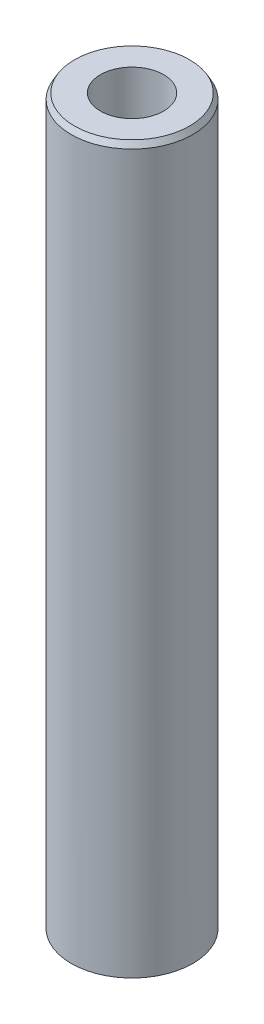
ISO-10303-21;
HEADER;
FILE_DESCRIPTION(('STEP AP214'),'2;1');
FILE_NAME('part.step','',(''),(''),'','','');
FILE_SCHEMA(('AUTOMOTIVE_DESIGN { 1 0 10303 214 1 1 1 1 }'));
ENDSEC;
DATA;
#1=APPLICATION_CONTEXT('core data for automotive mechanical design processes');
#2=APPLICATION_PROTOCOL_DEFINITION('international standard','automotive_design',2000,#1);
#3=PRODUCT_CONTEXT('',#1,'mechanical');
#4=PRODUCT('Part','Part','',(#3));
#5=PRODUCT_RELATED_PRODUCT_CATEGORY('part','',(#4));
#6=PRODUCT_DEFINITION_FORMATION('','',#4);
#7=PRODUCT_DEFINITION_CONTEXT('part definition',#1,'design');
#8=PRODUCT_DEFINITION('design','',#6,#7);
#9=PRODUCT_DEFINITION_SHAPE('','',#8);
#10=(LENGTH_UNIT() NAMED_UNIT(*) SI_UNIT(.MILLI.,.METRE.));
#11=(NAMED_UNIT(*) PLANE_ANGLE_UNIT() SI_UNIT($,.RADIAN.));
#12=(NAMED_UNIT(*) SI_UNIT($,.STERADIAN.) SOLID_ANGLE_UNIT());
#13=UNCERTAINTY_MEASURE_WITH_UNIT(LENGTH_MEASURE(1.E-05),#10,'distance_accuracy_value','');
#14=(GEOMETRIC_REPRESENTATION_CONTEXT(3) GLOBAL_UNCERTAINTY_ASSIGNED_CONTEXT((#13)) GLOBAL_UNIT_ASSIGNED_CONTEXT((#10,
#11,#12)) REPRESENTATION_CONTEXT('',''));
#15=CARTESIAN_POINT('',(0.,0.,0.));
#16=DIRECTION('',(0.,0.,1.));
#17=DIRECTION('',(1.,0.,0.));
#18=AXIS2_PLACEMENT_3D('',#15,#16,#17);
#19=CARTESIAN_POINT('',(0.,418.377284867305,0.));
#20=DIRECTION('',(0.,-1.,0.));
#21=DIRECTION('',(0.,0.,-1.));
#22=AXIS2_PLACEMENT_3D('',#19,#20,#21);
#23=CYLINDRICAL_SURFACE('',#22,35.);
#24=CARTESIAN_POINT('',(0.,415.081415115605,0.));
#25=DIRECTION('',(0.,1.,0.));
#26=DIRECTION('',(0.,0.,1.));
#27=AXIS2_PLACEMENT_3D('',#24,#25,#26);
#28=CIRCLE('',#27,35.);
#29=CARTESIAN_POINT('',(0.,415.081415115605,-35.));
#30=VERTEX_POINT('',#29);
#31=EDGE_CURVE('E50',#30,#30,#28,.F.);
#32=CARTESIAN_POINT('',(0.,1.90287128835798,0.));
#33=DIRECTION('',(0.,1.,0.));
#34=DIRECTION('',(0.,0.,1.));
#35=AXIS2_PLACEMENT_3D('',#32,#33,#34);
#36=CIRCLE('',#35,35.);
#37=CARTESIAN_POINT('',(0.,1.90287128835792,-35.));
#38=VERTEX_POINT('',#37);
#39=EDGE_CURVE('E51',#38,#38,#36,.T.);
#40=CARTESIAN_POINT('',(0.,415.081415115605,-35.));
#41=CARTESIAN_POINT('',(0.,410.777471950738,-35.));
#42=CARTESIAN_POINT('',(0.,406.473528785871,-35.));
#43=CARTESIAN_POINT('',(0.,397.865642456137,-35.));
#44=CARTESIAN_POINT('',(0.,393.56169929127,-35.));
#45=CARTESIAN_POINT('',(0.,384.953812961535,-35.));
#46=CARTESIAN_POINT('',(0.,380.649869796668,-35.));
#47=CARTESIAN_POINT('',(0.,372.041983466934,-35.));
#48=CARTESIAN_POINT('',(0.,367.738040302067,-35.));
#49=CARTESIAN_POINT('',(0.,359.130153972332,-35.));
#50=CARTESIAN_POINT('',(0.,354.826210807465,-35.));
#51=CARTESIAN_POINT('',(0.,346.218324477731,-35.));
#52=CARTESIAN_POINT('',(0.,341.914381312864,-35.));
#53=CARTESIAN_POINT('',(0.,333.306494983129,-35.));
#54=CARTESIAN_POINT('',(0.,329.002551818262,-35.));
#55=CARTESIAN_POINT('',(0.,320.394665488528,-35.));
#56=CARTESIAN_POINT('',(0.,316.090722323661,-35.));
#57=CARTESIAN_POINT('',(0.,307.482835993926,-35.));
#58=CARTESIAN_POINT('',(0.,303.178892829059,-35.));
#59=CARTESIAN_POINT('',(0.,294.571006499325,-35.));
#60=CARTESIAN_POINT('',(0.,290.267063334458,-35.));
#61=CARTESIAN_POINT('',(0.,281.659177004723,-35.));
#62=CARTESIAN_POINT('',(0.,277.355233839856,-35.));
#63=CARTESIAN_POINT('',(0.,268.747347510122,-35.));
#64=CARTESIAN_POINT('',(0.,264.443404345255,-35.));
#65=CARTESIAN_POINT('',(0.,255.83551801552,-35.));
#66=CARTESIAN_POINT('',(0.,251.531574850653,-35.));
#67=CARTESIAN_POINT('',(0.,242.923688520919,-35.));
#68=CARTESIAN_POINT('',(0.,238.619745356052,-35.));
#69=CARTESIAN_POINT('',(0.,230.011859026317,-35.));
#70=CARTESIAN_POINT('',(0.,225.70791586145,-35.));
#71=CARTESIAN_POINT('',(0.,217.100029531716,-35.));
#72=CARTESIAN_POINT('',(0.,212.796086366849,-35.));
#73=CARTESIAN_POINT('',(0.,204.188200037115,-35.));
#74=CARTESIAN_POINT('',(0.,199.884256872247,-35.));
#75=CARTESIAN_POINT('',(0.,191.276370542513,-35.));
#76=CARTESIAN_POINT('',(0.,186.972427377646,-35.));
#77=CARTESIAN_POINT('',(0.,178.364541047912,-35.));
#78=CARTESIAN_POINT('',(0.,174.060597883044,-35.));
#79=CARTESIAN_POINT('',(0.,165.45271155331,-35.));
#80=CARTESIAN_POINT('',(0.,161.148768388443,-35.));
#81=CARTESIAN_POINT('',(0.,152.540882058709,-35.));
#82=CARTESIAN_POINT('',(0.,148.236938893841,-35.));
#83=CARTESIAN_POINT('',(0.,139.629052564107,-35.));
#84=CARTESIAN_POINT('',(0.,135.32510939924,-35.));
#85=CARTESIAN_POINT('',(0.,126.717223069506,-35.));
#86=CARTESIAN_POINT('',(0.,122.413279904638,-35.));
#87=CARTESIAN_POINT('',(0.,113.805393574904,-35.));
#88=CARTESIAN_POINT('',(0.,109.501450410037,-35.));
#89=CARTESIAN_POINT('',(0.,100.893564080303,-35.));
#90=CARTESIAN_POINT('',(0.,96.5896209154355,-35.));
#91=CARTESIAN_POINT('',(0.,87.9817345857012,-35.));
#92=CARTESIAN_POINT('',(0.,83.677791420834,-35.));
#93=CARTESIAN_POINT('',(0.,75.0699050910997,-35.));
#94=CARTESIAN_POINT('',(0.,70.7659619262325,-35.));
#95=CARTESIAN_POINT('',(0.,62.1580755964982,-35.));
#96=CARTESIAN_POINT('',(0.,57.854132431631,-35.));
#97=CARTESIAN_POINT('',(0.,49.2462461018967,-35.));
#98=CARTESIAN_POINT('',(0.,44.9423029370296,-35.));
#99=CARTESIAN_POINT('',(0.,36.3344166072953,-35.));
#100=CARTESIAN_POINT('',(0.,32.0304734424281,-35.));
#101=CARTESIAN_POINT('',(0.,23.4225871126938,-35.));
#102=CARTESIAN_POINT('',(0.,19.1186439478266,-35.));
#103=CARTESIAN_POINT('',(0.,10.5107576180922,-35.));
#104=CARTESIAN_POINT('',(0.,6.20681445322508,-35.));
#105=CARTESIAN_POINT('',(0.,1.90287128835792,-35.));
#106=B_SPLINE_CURVE_WITH_KNOTS('',3,(#40,#41,#42,#43,#44,#45,#46,#47,#48,#49,#50,#51,#52,#53,
#54,#55,#56,#57,#58,#59,#60,#61,#62,#63,#64,#65,#66,#67,#68,#69,#70,#71,#72,#73,#74,#75,#76,#77,
#78,#79,#80,#81,#82,#83,#84,#85,#86,#87,#88,#89,#90,#91,#92,#93,#94,#95,#96,#97,#98,#99,#100,
#101,#102,#103,#104,#105),.UNSPECIFIED.,.F.,.F.,(4,2,2,2,2,2,2,2,2,2,2,2,2,2,2,2,2,2,2,2,2,2,2,
2,2,2,2,2,2,2,2,2,4),(0.,12.9118294946015,25.823658989203,38.7354884838045,51.6473179784059,
64.5591474730075,77.4709769676089,90.3828064622104,103.294635956812,116.206465451413,
129.118294946015,142.030124440616,154.941953935218,167.853783429819,180.765612924421,
193.677442419022,206.589271913624,219.501101408225,232.412930902827,245.324760397428,
258.23658989203,271.148419386631,284.060248881233,296.972078375834,309.883907870436,
322.795737365037,335.707566859639,348.61939635424,361.531225848842,374.443055343443,
387.354884838044,400.266714332646,413.178543827247),.UNSPECIFIED.);
#107=EDGE_CURVE('BSEAM39',#30,#38,#106,.T.);
#108=ORIENTED_EDGE('',*,*,#31,.T.);
#109=ORIENTED_EDGE('',*,*,#39,.T.);
#110=ORIENTED_EDGE('',*,*,#107,.T.);
#111=ORIENTED_EDGE('',*,*,#107,.F.);
#112=EDGE_LOOP('',(#108,#110,#109,#111));
#113=FACE_BOUND('',#112,.T.);
#114=ADVANCED_FACE('F39',(#113),#23,.T.);
#115=CARTESIAN_POINT('',(0.,418.377284867305,0.));
#116=DIRECTION('',(0.,1.,0.));
#117=DIRECTION('',(0.,0.,1.));
#118=AXIS2_PLACEMENT_3D('',#115,#116,#117);
#119=PLANE('',#118);
#120=CARTESIAN_POINT('',(0.,418.377284867305,0.));
#121=DIRECTION('',(0.,1.,0.));
#122=DIRECTION('',(0.,0.,1.));
#123=AXIS2_PLACEMENT_3D('',#120,#121,#122);
#124=CIRCLE('',#123,33.0971287116423);
#125=CARTESIAN_POINT('',(0.,418.377284867305,33.0971287116423));
#126=VERTEX_POINT('',#125);
#127=EDGE_CURVE('E54',#126,#126,#124,.T.);
#128=ORIENTED_EDGE('',*,*,#127,.T.);
#129=EDGE_LOOP('',(#128));
#130=FACE_BOUND('',#129,.T.);
#131=CARTESIAN_POINT('',(0.,418.377284867305,0.));
#132=DIRECTION('',(0.,1.,0.));
#133=DIRECTION('',(0.,0.,1.));
#134=AXIS2_PLACEMENT_3D('',#131,#132,#133);
#135=CIRCLE('',#134,18.1894607043037);
#136=CARTESIAN_POINT('',(0.,418.377284867305,-18.1894607043037));
#137=VERTEX_POINT('',#136);
#138=EDGE_CURVE('E58',#137,#137,#135,.T.);
#139=ORIENTED_EDGE('',*,*,#138,.F.);
#140=EDGE_LOOP('',(#139));
#141=FACE_BOUND('',#140,.T.);
#142=ADVANCED_FACE('F69',(#130,#141),#119,.T.);
#143=CARTESIAN_POINT('',(0.,0.,0.));
#144=DIRECTION('',(0.,1.,0.));
#145=DIRECTION('',(0.,0.,1.));
#146=AXIS2_PLACEMENT_3D('',#143,#144,#145);
#147=PLANE('',#146);
#148=CARTESIAN_POINT('',(0.,0.,0.));
#149=DIRECTION('',(0.,1.,0.));
#150=DIRECTION('',(0.,0.,1.));
#151=AXIS2_PLACEMENT_3D('',#148,#149,#150);
#152=CIRCLE('',#151,31.7041302482999);
#153=CARTESIAN_POINT('',(0.,0.,31.7041302482999));
#154=VERTEX_POINT('',#153);
#155=EDGE_CURVE('E10',#154,#154,#152,.F.);
#156=ORIENTED_EDGE('',*,*,#155,.T.);
#157=EDGE_LOOP('',(#156));
#158=FACE_BOUND('',#157,.T.);
#159=CARTESIAN_POINT('',(0.,0.,0.));
#160=DIRECTION('',(0.,1.,0.));
#161=DIRECTION('',(0.,0.,1.));
#162=AXIS2_PLACEMENT_3D('',#159,#160,#161);
#163=CIRCLE('',#162,18.1894607043037);
#164=CARTESIAN_POINT('',(0.,0.,-18.1894607043037));
#165=VERTEX_POINT('',#164);
#166=EDGE_CURVE('E63',#165,#165,#163,.T.);
#167=ORIENTED_EDGE('',*,*,#166,.T.);
#168=EDGE_LOOP('',(#167));
#169=FACE_BOUND('',#168,.T.);
#170=ADVANCED_FACE('F75',(#158,#169),#147,.F.);
#171=CARTESIAN_POINT('',(0.,418.377284867305,0.));
#172=DIRECTION('',(0.,-1.,0.));
#173=DIRECTION('',(0.,0.,-1.));
#174=AXIS2_PLACEMENT_3D('',#171,#172,#173);
#175=CYLINDRICAL_SURFACE('',#174,18.1894607043037);
#176=CARTESIAN_POINT('',(0.,418.377284867305,-18.1894607043037));
#177=CARTESIAN_POINT('',(0.,414.019188149937,-18.1894607043037));
#178=CARTESIAN_POINT('',(0.,409.661091432569,-18.1894607043037));
#179=CARTESIAN_POINT('',(0.,400.944897997834,-18.1894607043037));
#180=CARTESIAN_POINT('',(0.,396.586801280466,-18.1894607043037));
#181=CARTESIAN_POINT('',(0.,387.870607845731,-18.1894607043037));
#182=CARTESIAN_POINT('',(0.,383.512511128363,-18.1894607043037));
#183=CARTESIAN_POINT('',(0.,374.796317693627,-18.1894607043037));
#184=CARTESIAN_POINT('',(0.,370.43822097626,-18.1894607043037));
#185=CARTESIAN_POINT('',(0.,361.722027541524,-18.1894607043037));
#186=CARTESIAN_POINT('',(0.,357.363930824156,-18.1894607043037));
#187=CARTESIAN_POINT('',(0.,348.647737389421,-18.1894607043037));
#188=CARTESIAN_POINT('',(0.,344.289640672053,-18.1894607043037));
#189=CARTESIAN_POINT('',(0.,335.573447237318,-18.1894607043037));
#190=CARTESIAN_POINT('',(0.,331.21535051995,-18.1894607043037));
#191=CARTESIAN_POINT('',(0.,322.499157085214,-18.1894607043037));
#192=CARTESIAN_POINT('',(0.,318.141060367846,-18.1894607043037));
#193=CARTESIAN_POINT('',(0.,309.424866933111,-18.1894607043037));
#194=CARTESIAN_POINT('',(0.,305.066770215743,-18.1894607043037));
#195=CARTESIAN_POINT('',(0.,296.350576781008,-18.1894607043037));
#196=CARTESIAN_POINT('',(0.,291.99248006364,-18.1894607043037));
#197=CARTESIAN_POINT('',(0.,283.276286628904,-18.1894607043037));
#198=CARTESIAN_POINT('',(0.,278.918189911537,-18.1894607043037));
#199=CARTESIAN_POINT('',(0.,270.201996476801,-18.1894607043037));
#200=CARTESIAN_POINT('',(0.,265.843899759433,-18.1894607043037));
#201=CARTESIAN_POINT('',(0.,257.127706324698,-18.1894607043037));
#202=CARTESIAN_POINT('',(0.,252.76960960733,-18.1894607043037));
#203=CARTESIAN_POINT('',(0.,244.053416172595,-18.1894607043037));
#204=CARTESIAN_POINT('',(0.,239.695319455227,-18.1894607043037));
#205=CARTESIAN_POINT('',(0.,230.979126020491,-18.1894607043037));
#206=CARTESIAN_POINT('',(0.,226.621029303123,-18.1894607043037));
#207=CARTESIAN_POINT('',(0.,217.904835868388,-18.1894607043037));
#208=CARTESIAN_POINT('',(0.,213.54673915102,-18.1894607043037));
#209=CARTESIAN_POINT('',(0.,204.830545716285,-18.1894607043037));
#210=CARTESIAN_POINT('',(0.,200.472448998917,-18.1894607043037));
#211=CARTESIAN_POINT('',(0.,191.756255564181,-18.1894607043037));
#212=CARTESIAN_POINT('',(0.,187.398158846814,-18.1894607043037));
#213=CARTESIAN_POINT('',(0.,178.681965412078,-18.1894607043037));
#214=CARTESIAN_POINT('',(0.,174.32386869471,-18.1894607043037));
#215=CARTESIAN_POINT('',(0.,165.607675259975,-18.1894607043037));
#216=CARTESIAN_POINT('',(0.,161.249578542607,-18.1894607043037));
#217=CARTESIAN_POINT('',(0.,152.533385107872,-18.1894607043037));
#218=CARTESIAN_POINT('',(0.,148.175288390504,-18.1894607043037));
#219=CARTESIAN_POINT('',(0.,139.459094955768,-18.1894607043037));
#220=CARTESIAN_POINT('',(0.,135.100998238401,-18.1894607043037));
#221=CARTESIAN_POINT('',(0.,126.384804803665,-18.1894607043037));
#222=CARTESIAN_POINT('',(0.,122.026708086297,-18.1894607043037));
#223=CARTESIAN_POINT('',(0.,113.310514651562,-18.1894607043037));
#224=CARTESIAN_POINT('',(0.,108.952417934194,-18.1894607043037));
#225=CARTESIAN_POINT('',(0.,100.236224499458,-18.1894607043037));
#226=CARTESIAN_POINT('',(0.,95.8781277820907,-18.1894607043037));
#227=CARTESIAN_POINT('',(0.,87.1619343473552,-18.1894607043037));
#228=CARTESIAN_POINT('',(0.,82.8038376299874,-18.1894607043037));
#229=CARTESIAN_POINT('',(0.,74.0876441952519,-18.1894607043037));
#230=CARTESIAN_POINT('',(0.,69.7295474778841,-18.1894607043037));
#231=CARTESIAN_POINT('',(0.,61.0133540431486,-18.1894607043037));
#232=CARTESIAN_POINT('',(0.,56.6552573257809,-18.1894607043037));
#233=CARTESIAN_POINT('',(0.,47.9390638910453,-18.1894607043037));
#234=CARTESIAN_POINT('',(0.,43.5809671736776,-18.1894607043037));
#235=CARTESIAN_POINT('',(0.,34.864773738942,-18.1894607043037));
#236=CARTESIAN_POINT('',(0.,30.5066770215743,-18.1894607043037));
#237=CARTESIAN_POINT('',(0.,21.7904835868388,-18.1894607043037));
#238=CARTESIAN_POINT('',(0.,17.432386869471,-18.1894607043037));
#239=CARTESIAN_POINT('',(0.,8.71619343473545,-18.1894607043037));
#240=CARTESIAN_POINT('',(0.,4.3580967173677,-18.1894607043037));
#241=CARTESIAN_POINT('',(0.,0.,-18.1894607043037));
#242=B_SPLINE_CURVE_WITH_KNOTS('',3,(#176,#177,#178,#179,#180,#181,#182,#183,#184,#185,#186,
#187,#188,#189,#190,#191,#192,#193,#194,#195,#196,#197,#198,#199,#200,#201,#202,#203,#204,#205,
#206,#207,#208,#209,#210,#211,#212,#213,#214,#215,#216,#217,#218,#219,#220,#221,#222,#223,#224,
#225,#226,#227,#228,#229,#230,#231,#232,#233,#234,#235,#236,#237,#238,#239,#240,#241),
.UNSPECIFIED.,.F.,.F.,(4,2,2,2,2,2,2,2,2,2,2,2,2,2,2,2,2,2,2,2,2,2,2,2,2,2,2,2,2,2,2,2,4),(0.,
13.0742901521033,26.1485803042066,39.2228704563099,52.2971606084132,65.3714507605164,
78.4457409126197,91.520031064723,104.594321216826,117.66861136893,130.742901521033,
143.817191673136,156.891481825239,169.965771977343,183.040062129446,196.114352281549,
209.188642433653,222.262932585756,235.337222737859,248.411512889962,261.485803042066,
274.560093194169,287.634383346272,300.708673498376,313.782963650479,326.857253802582,
339.931543954685,353.005834106789,366.080124258892,379.154414410995,392.228704563098,
405.302994715202,418.377284867305),.UNSPECIFIED.);
#243=EDGE_CURVE('BSEAM70',#137,#165,#242,.T.);
#244=ORIENTED_EDGE('',*,*,#138,.T.);
#245=ORIENTED_EDGE('',*,*,#166,.F.);
#246=ORIENTED_EDGE('',*,*,#243,.T.);
#247=ORIENTED_EDGE('',*,*,#243,.F.);
#248=EDGE_LOOP('',(#244,#246,#245,#247));
#249=FACE_BOUND('',#248,.T.);
#250=ADVANCED_FACE('F70',(#249),#175,.F.);
#251=CARTESIAN_POINT('',(0.,418.377284867305,0.));
#252=DIRECTION('',(0.,-1.,0.));
#253=DIRECTION('',(0.,0.,-1.));
#254=AXIS2_PLACEMENT_3D('',#251,#252,#253);
#255=CONICAL_SURFACE('',#254,33.0971287116423,0.523598775598299);
#256=ORIENTED_EDGE('',*,*,#31,.F.);
#257=EDGE_LOOP('',(#256));
#258=FACE_BOUND('',#257,.T.);
#259=ORIENTED_EDGE('',*,*,#127,.F.);
#260=EDGE_LOOP('',(#259));
#261=FACE_BOUND('',#260,.T.);
#262=ADVANCED_FACE('F81',(#258,#261),#255,.T.);
#263=CARTESIAN_POINT('',(0.,1.90287128835798,0.));
#264=DIRECTION('',(0.,1.,0.));
#265=DIRECTION('',(0.,0.,1.));
#266=AXIS2_PLACEMENT_3D('',#263,#264,#265);
#267=CONICAL_SURFACE('',#266,35.,1.0471975511966);
#268=ORIENTED_EDGE('',*,*,#155,.F.);
#269=EDGE_LOOP('',(#268));
#270=FACE_BOUND('',#269,.T.);
#271=ORIENTED_EDGE('',*,*,#39,.F.);
#272=EDGE_LOOP('',(#271));
#273=FACE_BOUND('',#272,.T.);
#274=ADVANCED_FACE('F45',(#270,#273),#267,.T.);
#275=CLOSED_SHELL('',(#114,#142,#170,#250,#262,#274));
#276=MANIFOLD_SOLID_BREP('B2',#275);
#277=ADVANCED_BREP_SHAPE_REPRESENTATION('',(#18,#276),#14);
#278=SHAPE_DEFINITION_REPRESENTATION(#9,#277);
ENDSEC;
END-ISO-10303-21;
